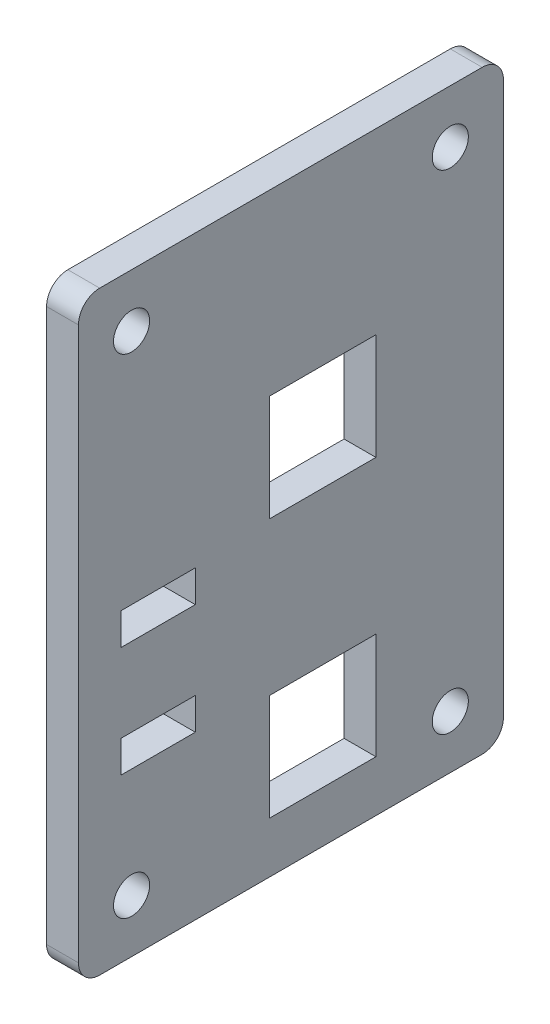
ISO-10303-21;
HEADER;
FILE_DESCRIPTION(('STEP AP214'),'2;1');
FILE_NAME('part.step','',(''),(''),'','','');
FILE_SCHEMA(('AUTOMOTIVE_DESIGN { 1 0 10303 214 1 1 1 1 }'));
ENDSEC;
DATA;
#1=APPLICATION_CONTEXT('core data for automotive mechanical design processes');
#2=APPLICATION_PROTOCOL_DEFINITION('international standard','automotive_design',2000,#1);
#3=PRODUCT_CONTEXT('',#1,'mechanical');
#4=PRODUCT('Part','Part','',(#3));
#5=PRODUCT_RELATED_PRODUCT_CATEGORY('part','',(#4));
#6=PRODUCT_DEFINITION_FORMATION('','',#4);
#7=PRODUCT_DEFINITION_CONTEXT('part definition',#1,'design');
#8=PRODUCT_DEFINITION('design','',#6,#7);
#9=PRODUCT_DEFINITION_SHAPE('','',#8);
#10=(LENGTH_UNIT() NAMED_UNIT(*) SI_UNIT(.MILLI.,.METRE.));
#11=(NAMED_UNIT(*) PLANE_ANGLE_UNIT() SI_UNIT($,.RADIAN.));
#12=(NAMED_UNIT(*) SI_UNIT($,.STERADIAN.) SOLID_ANGLE_UNIT());
#13=UNCERTAINTY_MEASURE_WITH_UNIT(LENGTH_MEASURE(1.E-05),#10,'distance_accuracy_value','');
#14=(GEOMETRIC_REPRESENTATION_CONTEXT(3) GLOBAL_UNCERTAINTY_ASSIGNED_CONTEXT((#13)) GLOBAL_UNIT_ASSIGNED_CONTEXT((#10,
#11,#12)) REPRESENTATION_CONTEXT('',''));
#15=CARTESIAN_POINT('',(0.,0.,0.));
#16=DIRECTION('',(0.,0.,1.));
#17=DIRECTION('',(1.,0.,0.));
#18=AXIS2_PLACEMENT_3D('',#15,#16,#17);
#19=CARTESIAN_POINT('',(-14.9999999999989,231.000000000002,115.));
#20=DIRECTION('',(0.,0.,1.));
#21=DIRECTION('',(0.,-1.,0.));
#22=AXIS2_PLACEMENT_3D('',#19,#20,#21);
#23=PLANE('',#22);
#24=DIRECTION('',(0.,-1.,0.));
#25=VECTOR('',#24,1.);
#26=CARTESIAN_POINT('',(1.11022302462516E-12,231.000000000002,115.));
#27=LINE('',#26,#25);
#28=CARTESIAN_POINT('',(1.11022302462516E-12,221.000000000002,114.999999999999));
#29=VERTEX_POINT('',#28);
#30=CARTESIAN_POINT('',(0.,-38.9999999999998,114.999999999999));
#31=VERTEX_POINT('',#30);
#32=EDGE_CURVE('E402',#29,#31,#27,.T.);
#33=ORIENTED_EDGE('',*,*,#32,.F.);
#34=DIRECTION('',(1.,0.,0.));
#35=VECTOR('',#34,1.);
#36=CARTESIAN_POINT('',(-14.9999999999989,221.000000000002,114.999999999999));
#37=LINE('',#36,#35);
#38=CARTESIAN_POINT('',(-14.9999999999989,221.000000000002,114.999999999999));
#39=VERTEX_POINT('',#38);
#40=EDGE_CURVE('E485',#29,#39,#37,.F.);
#41=ORIENTED_EDGE('',*,*,#40,.T.);
#42=DIRECTION('',(0.,-1.,0.));
#43=VECTOR('',#42,1.);
#44=CARTESIAN_POINT('',(-14.9999999999989,231.000000000002,115.));
#45=LINE('',#44,#43);
#46=CARTESIAN_POINT('',(-15.,-38.9999999999953,114.999999999999));
#47=VERTEX_POINT('',#46);
#48=EDGE_CURVE('E412',#39,#47,#45,.T.);
#49=ORIENTED_EDGE('',*,*,#48,.T.);
#50=DIRECTION('',(1.,0.,0.));
#51=VECTOR('',#50,1.);
#52=CARTESIAN_POINT('',(-15.,-38.9999999999953,114.999999999999));
#53=LINE('',#52,#51);
#54=EDGE_CURVE('E481',#47,#31,#53,.T.);
#55=ORIENTED_EDGE('',*,*,#54,.T.);
#56=EDGE_LOOP('',(#33,#41,#49,#55));
#57=FACE_BOUND('',#56,.T.);
#58=ADVANCED_FACE('F38',(#57),#23,.T.);
#59=CARTESIAN_POINT('',(-14.9999999999989,231.000000000002,115.));
#60=DIRECTION('',(0.,1.,0.));
#61=DIRECTION('',(0.,0.,1.));
#62=AXIS2_PLACEMENT_3D('',#59,#60,#61);
#63=PLANE('',#62);
#64=DIRECTION('',(0.,0.,1.));
#65=VECTOR('',#64,1.);
#66=CARTESIAN_POINT('',(1.11022302462516E-12,231.000000000002,115.));
#67=LINE('',#66,#65);
#68=CARTESIAN_POINT('',(1.11022302462516E-12,231.000000000002,-75.));
#69=VERTEX_POINT('',#68);
#70=CARTESIAN_POINT('',(1.11022302462516E-12,231.000000000002,105.));
#71=VERTEX_POINT('',#70);
#72=EDGE_CURVE('E417',#69,#71,#67,.T.);
#73=ORIENTED_EDGE('',*,*,#72,.F.);
#74=DIRECTION('',(1.,0.,0.));
#75=VECTOR('',#74,1.);
#76=CARTESIAN_POINT('',(-14.9999999999989,231.000000000002,-75.));
#77=LINE('',#76,#75);
#78=CARTESIAN_POINT('',(-14.9999999999989,231.000000000002,-75.));
#79=VERTEX_POINT('',#78);
#80=EDGE_CURVE('E466',#69,#79,#77,.F.);
#81=ORIENTED_EDGE('',*,*,#80,.T.);
#82=DIRECTION('',(0.,0.,1.));
#83=VECTOR('',#82,1.);
#84=CARTESIAN_POINT('',(-14.9999999999989,231.000000000002,115.));
#85=LINE('',#84,#83);
#86=CARTESIAN_POINT('',(-14.9999999999989,231.000000000002,105.));
#87=VERTEX_POINT('',#86);
#88=EDGE_CURVE('E425',#79,#87,#85,.T.);
#89=ORIENTED_EDGE('',*,*,#88,.T.);
#90=DIRECTION('',(1.,0.,0.));
#91=VECTOR('',#90,1.);
#92=CARTESIAN_POINT('',(-14.9999999999989,231.000000000002,105.));
#93=LINE('',#92,#91);
#94=EDGE_CURVE('E462',#87,#71,#93,.T.);
#95=ORIENTED_EDGE('',*,*,#94,.T.);
#96=EDGE_LOOP('',(#73,#81,#89,#95));
#97=FACE_BOUND('',#96,.T.);
#98=ADVANCED_FACE('F518',(#97),#63,.T.);
#99=CARTESIAN_POINT('',(-14.9999999999989,231.,-85.));
#100=DIRECTION('',(0.,0.,-1.));
#101=DIRECTION('',(0.,1.,0.));
#102=AXIS2_PLACEMENT_3D('',#99,#100,#101);
#103=PLANE('',#102);
#104=DIRECTION('',(0.,1.,0.));
#105=VECTOR('',#104,1.);
#106=CARTESIAN_POINT('',(-14.9999999999989,231.,-85.));
#107=LINE('',#106,#105);
#108=CARTESIAN_POINT('',(-15.,-39.0000000000004,-85.0000000000011));
#109=VERTEX_POINT('',#108);
#110=CARTESIAN_POINT('',(-14.9999999999989,221.,-85.0000000000011));
#111=VERTEX_POINT('',#110);
#112=EDGE_CURVE('E421',#109,#111,#107,.T.);
#113=ORIENTED_EDGE('',*,*,#112,.T.);
#114=DIRECTION('',(1.,0.,0.));
#115=VECTOR('',#114,1.);
#116=CARTESIAN_POINT('',(-14.9999999999989,221.,-85.0000000000011));
#117=LINE('',#116,#115);
#118=CARTESIAN_POINT('',(1.11022302462516E-12,221.,-85.0000000000011));
#119=VERTEX_POINT('',#118);
#120=EDGE_CURVE('E446',#111,#119,#117,.T.);
#121=ORIENTED_EDGE('',*,*,#120,.T.);
#122=DIRECTION('',(0.,1.,0.));
#123=VECTOR('',#122,1.);
#124=CARTESIAN_POINT('',(1.11022302462516E-12,231.,-85.));
#125=LINE('',#124,#123);
#126=CARTESIAN_POINT('',(0.,-38.9999999999959,-85.0000000000011));
#127=VERTEX_POINT('',#126);
#128=EDGE_CURVE('E437',#127,#119,#125,.T.);
#129=ORIENTED_EDGE('',*,*,#128,.F.);
#130=DIRECTION('',(1.,0.,0.));
#131=VECTOR('',#130,1.);
#132=CARTESIAN_POINT('',(-15.,-39.0000000000004,-85.0000000000011));
#133=LINE('',#132,#131);
#134=EDGE_CURVE('E429',#127,#109,#133,.F.);
#135=ORIENTED_EDGE('',*,*,#134,.T.);
#136=EDGE_LOOP('',(#113,#121,#129,#135));
#137=FACE_BOUND('',#136,.T.);
#138=ADVANCED_FACE('F525',(#137),#103,.T.);
#139=CARTESIAN_POINT('',(-15.,-48.9999999999953,114.999999999999));
#140=DIRECTION('',(0.,-1.,0.));
#141=DIRECTION('',(0.,0.,-1.));
#142=AXIS2_PLACEMENT_3D('',#139,#140,#141);
#143=PLANE('',#142);
#144=DIRECTION('',(0.,0.,-1.));
#145=VECTOR('',#144,1.);
#146=CARTESIAN_POINT('',(0.,-48.9999999999998,115.));
#147=LINE('',#146,#145);
#148=CARTESIAN_POINT('',(0.,-48.9999999999998,105.));
#149=VERTEX_POINT('',#148);
#150=CARTESIAN_POINT('',(0.,-48.9999999999959,-74.9999999999999));
#151=VERTEX_POINT('',#150);
#152=EDGE_CURVE('E433',#149,#151,#147,.T.);
#153=ORIENTED_EDGE('',*,*,#152,.F.);
#154=DIRECTION('',(1.,0.,0.));
#155=VECTOR('',#154,1.);
#156=CARTESIAN_POINT('',(-15.,-48.9999999999953,104.999999999999));
#157=LINE('',#156,#155);
#158=CARTESIAN_POINT('',(-15.,-48.9999999999953,104.999999999999));
#159=VERTEX_POINT('',#158);
#160=EDGE_CURVE('E11',#149,#159,#157,.F.);
#161=ORIENTED_EDGE('',*,*,#160,.T.);
#162=DIRECTION('',(0.,0.,-1.));
#163=VECTOR('',#162,1.);
#164=CARTESIAN_POINT('',(-15.,-48.9999999999953,114.999999999999));
#165=LINE('',#164,#163);
#166=CARTESIAN_POINT('',(-15.,-49.0000000000004,-75.0000000000011));
#167=VERTEX_POINT('',#166);
#168=EDGE_CURVE('E416',#159,#167,#165,.T.);
#169=ORIENTED_EDGE('',*,*,#168,.T.);
#170=DIRECTION('',(1.,0.,0.));
#171=VECTOR('',#170,1.);
#172=CARTESIAN_POINT('',(-15.,-49.0000000000004,-75.0000000000011));
#173=LINE('',#172,#171);
#174=EDGE_CURVE('E47',#167,#151,#173,.T.);
#175=ORIENTED_EDGE('',*,*,#174,.T.);
#176=EDGE_LOOP('',(#153,#161,#169,#175));
#177=FACE_BOUND('',#176,.T.);
#178=ADVANCED_FACE('F494',(#177),#143,.T.);
#179=CARTESIAN_POINT('',(-15.,-3.88578058618805E-13,0.));
#180=DIRECTION('',(1.,0.,0.));
#181=DIRECTION('',(0.,0.,-1.));
#182=AXIS2_PLACEMENT_3D('',#179,#180,#181);
#183=PLANE('',#182);
#184=DIRECTION('',(0.,0.,1.));
#185=VECTOR('',#184,1.);
#186=CARTESIAN_POINT('',(-14.9999999999999,27.5000000000001,60.));
#187=LINE('',#186,#185);
#188=CARTESIAN_POINT('',(-14.9999999999999,27.5000000000001,60.));
#189=VERTEX_POINT('',#188);
#190=CARTESIAN_POINT('',(-14.9999999999999,27.5000000000003,95.));
#191=VERTEX_POINT('',#190);
#192=EDGE_CURVE('E230',#189,#191,#187,.T.);
#193=ORIENTED_EDGE('',*,*,#192,.F.);
#194=DIRECTION('',(0.,-1.,0.));
#195=VECTOR('',#194,1.);
#196=CARTESIAN_POINT('',(-15.,42.5000000000001,60.));
#197=LINE('',#196,#195);
#198=CARTESIAN_POINT('',(-15.,42.5000000000001,60.));
#199=VERTEX_POINT('',#198);
#200=EDGE_CURVE('E219',#199,#189,#197,.T.);
#201=ORIENTED_EDGE('',*,*,#200,.F.);
#202=DIRECTION('',(0.,0.,-1.));
#203=VECTOR('',#202,1.);
#204=CARTESIAN_POINT('',(-15.,42.5000000000001,60.));
#205=LINE('',#204,#203);
#206=CARTESIAN_POINT('',(-15.,42.5,94.9999999999989));
#207=VERTEX_POINT('',#206);
#208=EDGE_CURVE('E234',#207,#199,#205,.T.);
#209=ORIENTED_EDGE('',*,*,#208,.F.);
#210=DIRECTION('',(0.,1.,0.));
#211=VECTOR('',#210,1.);
#212=CARTESIAN_POINT('',(-15.,42.5,94.9999999999989));
#213=LINE('',#212,#211);
#214=EDGE_CURVE('E54',#191,#207,#213,.T.);
#215=ORIENTED_EDGE('',*,*,#214,.F.);
#216=EDGE_LOOP('',(#193,#201,#209,#215));
#217=FACE_BOUND('',#216,.T.);
#218=DIRECTION('',(0.,1.,0.));
#219=VECTOR('',#218,1.);
#220=CARTESIAN_POINT('',(-14.9999999999918,79.5,95.0000000000001));
#221=LINE('',#220,#219);
#222=CARTESIAN_POINT('',(-14.9999999999918,79.5,95.0000000000001));
#223=VERTEX_POINT('',#222);
#224=CARTESIAN_POINT('',(-15.,94.5000000000001,95.));
#225=VERTEX_POINT('',#224);
#226=EDGE_CURVE('E253',#223,#225,#221,.T.);
#227=ORIENTED_EDGE('',*,*,#226,.F.);
#228=DIRECTION('',(0.,0.,1.));
#229=VECTOR('',#228,1.);
#230=CARTESIAN_POINT('',(-14.9999999999918,79.5,59.9999999999999));
#231=LINE('',#230,#229);
#232=CARTESIAN_POINT('',(-14.9999999999918,79.5,59.9999999999999));
#233=VERTEX_POINT('',#232);
#234=EDGE_CURVE('E257',#233,#223,#231,.T.);
#235=ORIENTED_EDGE('',*,*,#234,.F.);
#236=DIRECTION('',(0.,-1.,0.));
#237=VECTOR('',#236,1.);
#238=CARTESIAN_POINT('',(-14.9999999999918,79.5,59.9999999999999));
#239=LINE('',#238,#237);
#240=CARTESIAN_POINT('',(-14.9999999999992,94.5000000000001,60.));
#241=VERTEX_POINT('',#240);
#242=EDGE_CURVE('E261',#241,#233,#239,.T.);
#243=ORIENTED_EDGE('',*,*,#242,.F.);
#244=DIRECTION('',(0.,0.,-1.));
#245=VECTOR('',#244,1.);
#246=CARTESIAN_POINT('',(-14.9999999999992,94.5000000000001,60.));
#247=LINE('',#246,#245);
#248=EDGE_CURVE('E62',#225,#241,#247,.T.);
#249=ORIENTED_EDGE('',*,*,#248,.F.);
#250=EDGE_LOOP('',(#227,#235,#243,#249));
#251=FACE_BOUND('',#250,.T.);
#252=CARTESIAN_POINT('',(-14.9999999999999,-24.0000000000004,-60.0000000000011));
#253=DIRECTION('',(1.,0.,0.));
#254=DIRECTION('',(0.,0.,-1.));
#255=AXIS2_PLACEMENT_3D('',#252,#253,#254);
#256=CIRCLE('',#255,8.50000000000001);
#257=CARTESIAN_POINT('',(-14.9999999999999,-24.0000000000004,-68.5000000000011));
#258=VERTEX_POINT('',#257);
#259=EDGE_CURVE('E292',#258,#258,#256,.T.);
#260=ORIENTED_EDGE('',*,*,#259,.T.);
#261=EDGE_LOOP('',(#260));
#262=FACE_BOUND('',#261,.T.);
#263=CARTESIAN_POINT('',(-14.9999999999989,206.000000000002,89.9999999999989));
#264=DIRECTION('',(1.,0.,0.));
#265=DIRECTION('',(0.,0.,-1.));
#266=AXIS2_PLACEMENT_3D('',#263,#264,#265);
#267=CIRCLE('',#266,8.50000000000001);
#268=CARTESIAN_POINT('',(-14.9999999999989,206.000000000002,81.4999999999989));
#269=VERTEX_POINT('',#268);
#270=EDGE_CURVE('E301',#269,#269,#267,.T.);
#271=ORIENTED_EDGE('',*,*,#270,.T.);
#272=EDGE_LOOP('',(#271));
#273=FACE_BOUND('',#272,.T.);
#274=CARTESIAN_POINT('',(-14.9999999999999,-23.9999999999959,89.9999999999989));
#275=DIRECTION('',(1.,0.,0.));
#276=DIRECTION('',(0.,0.,-1.));
#277=AXIS2_PLACEMENT_3D('',#274,#275,#276);
#278=CIRCLE('',#277,8.50000000000001);
#279=CARTESIAN_POINT('',(-14.9999999999999,-23.9999999999959,81.4999999999989));
#280=VERTEX_POINT('',#279);
#281=EDGE_CURVE('E309',#280,#280,#278,.T.);
#282=ORIENTED_EDGE('',*,*,#281,.T.);
#283=EDGE_LOOP('',(#282));
#284=FACE_BOUND('',#283,.T.);
#285=CARTESIAN_POINT('',(-14.9999999999981,206.000000000002,-60.));
#286=DIRECTION('',(1.,0.,0.));
#287=DIRECTION('',(0.,0.,-1.));
#288=AXIS2_PLACEMENT_3D('',#285,#286,#287);
#289=CIRCLE('',#288,8.50000000000001);
#290=CARTESIAN_POINT('',(-14.9999999999982,206.000000000002,-68.5));
#291=VERTEX_POINT('',#290);
#292=EDGE_CURVE('E316',#291,#291,#289,.T.);
#293=ORIENTED_EDGE('',*,*,#292,.T.);
#294=EDGE_LOOP('',(#293));
#295=FACE_BOUND('',#294,.T.);
#296=DIRECTION('',(0.,0.,1.));
#297=VECTOR('',#296,1.);
#298=CARTESIAN_POINT('',(-14.9999999999918,25.000000000002,-25.0000000000001));
#299=LINE('',#298,#297);
#300=CARTESIAN_POINT('',(-14.9999999999918,25.000000000002,-25.0000000000001));
#301=VERTEX_POINT('',#300);
#302=CARTESIAN_POINT('',(-14.9999999999918,25.0000000000021,24.9999999999997));
#303=VERTEX_POINT('',#302);
#304=EDGE_CURVE('E337',#301,#303,#299,.T.);
#305=ORIENTED_EDGE('',*,*,#304,.T.);
#306=DIRECTION('',(0.,-1.,0.));
#307=VECTOR('',#306,1.);
#308=CARTESIAN_POINT('',(-14.9999999999999,-24.9999999999982,25.));
#309=LINE('',#308,#307);
#310=CARTESIAN_POINT('',(-14.9999999999999,-24.9999999999982,25.));
#311=VERTEX_POINT('',#310);
#312=EDGE_CURVE('E324',#303,#311,#309,.T.);
#313=ORIENTED_EDGE('',*,*,#312,.T.);
#314=DIRECTION('',(0.,0.,-1.));
#315=VECTOR('',#314,1.);
#316=CARTESIAN_POINT('',(-14.9999999999999,-25.0000000000004,-25.0000000000001));
#317=LINE('',#316,#315);
#318=CARTESIAN_POINT('',(-14.9999999999999,-25.0000000000004,-25.0000000000001));
#319=VERTEX_POINT('',#318);
#320=EDGE_CURVE('E328',#311,#319,#317,.T.);
#321=ORIENTED_EDGE('',*,*,#320,.T.);
#322=DIRECTION('',(0.,1.,0.));
#323=VECTOR('',#322,1.);
#324=CARTESIAN_POINT('',(-14.9999999999999,-25.0000000000004,-25.0000000000001));
#325=LINE('',#324,#323);
#326=EDGE_CURVE('E333',#319,#301,#325,.T.);
#327=ORIENTED_EDGE('',*,*,#326,.T.);
#328=EDGE_LOOP('',(#305,#313,#321,#327));
#329=FACE_BOUND('',#328,.T.);
#330=DIRECTION('',(0.,0.,1.));
#331=VECTOR('',#330,1.);
#332=CARTESIAN_POINT('',(-14.9999999999992,147.,24.9999999999997));
#333=LINE('',#332,#331);
#334=CARTESIAN_POINT('',(-14.9999999999992,147.000000000002,-25.0000000000001));
#335=VERTEX_POINT('',#334);
#336=CARTESIAN_POINT('',(-14.9999999999992,147.,24.9999999999997));
#337=VERTEX_POINT('',#336);
#338=EDGE_CURVE('E381',#335,#337,#333,.T.);
#339=ORIENTED_EDGE('',*,*,#338,.T.);
#340=DIRECTION('',(0.,-1.,0.));
#341=VECTOR('',#340,1.);
#342=CARTESIAN_POINT('',(-14.9999999999992,147.,24.9999999999997));
#343=LINE('',#342,#341);
#344=CARTESIAN_POINT('',(-15.,97.0000000000021,25.));
#345=VERTEX_POINT('',#344);
#346=EDGE_CURVE('E368',#337,#345,#343,.T.);
#347=ORIENTED_EDGE('',*,*,#346,.T.);
#348=DIRECTION('',(0.,0.,-1.));
#349=VECTOR('',#348,1.);
#350=CARTESIAN_POINT('',(-15.,97.0000000000021,25.));
#351=LINE('',#350,#349);
#352=CARTESIAN_POINT('',(-14.9999999999992,97.0000000000021,-25.));
#353=VERTEX_POINT('',#352);
#354=EDGE_CURVE('E372',#345,#353,#351,.T.);
#355=ORIENTED_EDGE('',*,*,#354,.T.);
#356=DIRECTION('',(0.,1.,0.));
#357=VECTOR('',#356,1.);
#358=CARTESIAN_POINT('',(-14.9999999999992,147.000000000002,-25.0000000000001));
#359=LINE('',#358,#357);
#360=EDGE_CURVE('E377',#353,#335,#359,.T.);
#361=ORIENTED_EDGE('',*,*,#360,.T.);
#362=EDGE_LOOP('',(#339,#347,#355,#361));
#363=FACE_BOUND('',#362,.T.);
#364=ORIENTED_EDGE('',*,*,#88,.F.);
#365=CARTESIAN_POINT('',(-14.9999999999989,221.000000000002,-75.0000000000011));
#366=DIRECTION('',(1.,0.,0.));
#367=DIRECTION('',(0.,0.,-1.));
#368=AXIS2_PLACEMENT_3D('',#365,#366,#367);
#369=CIRCLE('',#368,10.);
#370=EDGE_CURVE('E478',#79,#111,#369,.F.);
#371=ORIENTED_EDGE('',*,*,#370,.T.);
#372=ORIENTED_EDGE('',*,*,#112,.F.);
#373=CARTESIAN_POINT('',(-15.,-39.0000000000004,-75.0000000000011));
#374=DIRECTION('',(1.,0.,0.));
#375=DIRECTION('',(0.,0.,-1.));
#376=AXIS2_PLACEMENT_3D('',#373,#374,#375);
#377=CIRCLE('',#376,10.);
#378=EDGE_CURVE('E469',#109,#167,#377,.F.);
#379=ORIENTED_EDGE('',*,*,#378,.T.);
#380=ORIENTED_EDGE('',*,*,#168,.F.);
#381=CARTESIAN_POINT('',(-15.,-38.9999999999953,104.999999999999));
#382=DIRECTION('',(1.,0.,0.));
#383=DIRECTION('',(0.,0.,-1.));
#384=AXIS2_PLACEMENT_3D('',#381,#382,#383);
#385=CIRCLE('',#384,10.);
#386=EDGE_CURVE('E472',#159,#47,#385,.F.);
#387=ORIENTED_EDGE('',*,*,#386,.T.);
#388=ORIENTED_EDGE('',*,*,#48,.F.);
#389=CARTESIAN_POINT('',(-14.9999999999989,221.000000000002,104.999999999999));
#390=DIRECTION('',(1.,0.,0.));
#391=DIRECTION('',(0.,0.,-1.));
#392=AXIS2_PLACEMENT_3D('',#389,#390,#391);
#393=CIRCLE('',#392,10.);
#394=EDGE_CURVE('E475',#39,#87,#393,.F.);
#395=ORIENTED_EDGE('',*,*,#394,.T.);
#396=EDGE_LOOP('',(#364,#371,#372,#379,#380,#387,#388,#395));
#397=FACE_BOUND('',#396,.T.);
#398=ADVANCED_FACE('F512',(#217,#251,#262,#273,#284,#295,#329,#363,#397),#183,.F.);
#399=CARTESIAN_POINT('',(0.,0.,0.));
#400=DIRECTION('',(1.,0.,0.));
#401=DIRECTION('',(0.,0.,-1.));
#402=AXIS2_PLACEMENT_3D('',#399,#400,#401);
#403=PLANE('',#402);
#404=DIRECTION('',(0.,-1.,0.));
#405=VECTOR('',#404,1.);
#406=CARTESIAN_POINT('',(0.,42.5000000000001,60.0000000000001));
#407=LINE('',#406,#405);
#408=CARTESIAN_POINT('',(0.,42.5000000000001,60.0000000000001));
#409=VERTEX_POINT('',#408);
#410=CARTESIAN_POINT('',(0.,27.5000000000001,60.));
#411=VERTEX_POINT('',#410);
#412=EDGE_CURVE('E216',#409,#411,#407,.T.);
#413=ORIENTED_EDGE('',*,*,#412,.T.);
#414=DIRECTION('',(0.,0.,1.));
#415=VECTOR('',#414,1.);
#416=CARTESIAN_POINT('',(0.,27.5000000000001,60.));
#417=LINE('',#416,#415);
#418=CARTESIAN_POINT('',(0.,27.5000000000023,95.));
#419=VERTEX_POINT('',#418);
#420=EDGE_CURVE('E201',#411,#419,#417,.T.);
#421=ORIENTED_EDGE('',*,*,#420,.T.);
#422=DIRECTION('',(0.,1.,0.));
#423=VECTOR('',#422,1.);
#424=CARTESIAN_POINT('',(0.,42.5000000000003,94.9999999999989));
#425=LINE('',#424,#423);
#426=CARTESIAN_POINT('',(0.,42.5000000000003,94.9999999999989));
#427=VERTEX_POINT('',#426);
#428=EDGE_CURVE('E240',#419,#427,#425,.T.);
#429=ORIENTED_EDGE('',*,*,#428,.T.);
#430=DIRECTION('',(0.,0.,-1.));
#431=VECTOR('',#430,1.);
#432=CARTESIAN_POINT('',(0.,42.5000000000001,60.0000000000001));
#433=LINE('',#432,#431);
#434=EDGE_CURVE('E225',#427,#409,#433,.T.);
#435=ORIENTED_EDGE('',*,*,#434,.T.);
#436=EDGE_LOOP('',(#413,#421,#429,#435));
#437=FACE_BOUND('',#436,.T.);
#438=DIRECTION('',(0.,0.,1.));
#439=VECTOR('',#438,1.);
#440=CARTESIAN_POINT('',(8.21565038222616E-12,79.5000000000003,60.));
#441=LINE('',#440,#439);
#442=CARTESIAN_POINT('',(8.21565038222616E-12,79.5000000000003,60.));
#443=VERTEX_POINT('',#442);
#444=CARTESIAN_POINT('',(8.21565038222616E-12,79.5000000000003,95.0000000000001));
#445=VERTEX_POINT('',#444);
#446=EDGE_CURVE('E252',#443,#445,#441,.T.);
#447=ORIENTED_EDGE('',*,*,#446,.T.);
#448=DIRECTION('',(0.,1.,0.));
#449=VECTOR('',#448,1.);
#450=CARTESIAN_POINT('',(8.21565038222616E-12,79.5000000000003,95.0000000000001));
#451=LINE('',#450,#449);
#452=CARTESIAN_POINT('',(7.7715611723761E-13,94.5000000000003,95.));
#453=VERTEX_POINT('',#452);
#454=EDGE_CURVE('E280',#445,#453,#451,.T.);
#455=ORIENTED_EDGE('',*,*,#454,.T.);
#456=DIRECTION('',(0.,0.,-1.));
#457=VECTOR('',#456,1.);
#458=CARTESIAN_POINT('',(7.7715611723761E-13,94.5000000000003,60.0000000000001));
#459=LINE('',#458,#457);
#460=CARTESIAN_POINT('',(7.7715611723761E-13,94.5000000000003,60.0000000000001));
#461=VERTEX_POINT('',#460);
#462=EDGE_CURVE('E275',#453,#461,#459,.T.);
#463=ORIENTED_EDGE('',*,*,#462,.T.);
#464=DIRECTION('',(0.,-1.,0.));
#465=VECTOR('',#464,1.);
#466=CARTESIAN_POINT('',(8.21565038222616E-12,79.5000000000003,60.));
#467=LINE('',#466,#465);
#468=EDGE_CURVE('E269',#461,#443,#467,.T.);
#469=ORIENTED_EDGE('',*,*,#468,.T.);
#470=EDGE_LOOP('',(#447,#455,#463,#469));
#471=FACE_BOUND('',#470,.T.);
#472=CARTESIAN_POINT('',(0.,-24.,-60.0000000000002));
#473=DIRECTION('',(1.,0.,0.));
#474=DIRECTION('',(0.,0.,-1.));
#475=AXIS2_PLACEMENT_3D('',#472,#473,#474);
#476=CIRCLE('',#475,8.50000000000001);
#477=CARTESIAN_POINT('',(0.,-24.,-68.5000000000002));
#478=VERTEX_POINT('',#477);
#479=EDGE_CURVE('E297',#478,#478,#476,.T.);
#480=ORIENTED_EDGE('',*,*,#479,.F.);
#481=EDGE_LOOP('',(#480));
#482=FACE_BOUND('',#481,.T.);
#483=CARTESIAN_POINT('',(1.88737914186277E-12,206.000000000002,89.9999999999989));
#484=DIRECTION('',(1.,0.,0.));
#485=DIRECTION('',(0.,0.,-1.));
#486=AXIS2_PLACEMENT_3D('',#483,#484,#485);
#487=CIRCLE('',#486,8.50000000000001);
#488=CARTESIAN_POINT('',(1.84915971424005E-12,206.000000000002,81.4999999999989));
#489=VERTEX_POINT('',#488);
#490=EDGE_CURVE('E305',#489,#489,#487,.T.);
#491=ORIENTED_EDGE('',*,*,#490,.F.);
#492=EDGE_LOOP('',(#491));
#493=FACE_BOUND('',#492,.T.);
#494=CARTESIAN_POINT('',(0.,-23.9999999999998,89.9999999999989));
#495=DIRECTION('',(1.,0.,0.));
#496=DIRECTION('',(0.,0.,-1.));
#497=AXIS2_PLACEMENT_3D('',#494,#495,#496);
#498=CIRCLE('',#497,8.50000000000001);
#499=CARTESIAN_POINT('',(0.,-23.9999999999998,81.4999999999989));
#500=VERTEX_POINT('',#499);
#501=EDGE_CURVE('E249',#500,#500,#498,.T.);
#502=ORIENTED_EDGE('',*,*,#501,.F.);
#503=EDGE_LOOP('',(#502));
#504=FACE_BOUND('',#503,.T.);
#505=CARTESIAN_POINT('',(1.88737914186277E-12,206.000000000002,-60.));
#506=DIRECTION('',(1.,0.,0.));
#507=DIRECTION('',(0.,0.,-1.));
#508=AXIS2_PLACEMENT_3D('',#505,#506,#507);
#509=CIRCLE('',#508,8.50000000000001);
#510=CARTESIAN_POINT('',(1.84915971424005E-12,206.000000000002,-68.5));
#511=VERTEX_POINT('',#510);
#512=EDGE_CURVE('E296',#511,#511,#509,.T.);
#513=ORIENTED_EDGE('',*,*,#512,.F.);
#514=EDGE_LOOP('',(#513));
#515=FACE_BOUND('',#514,.T.);
#516=DIRECTION('',(0.,-1.,0.));
#517=VECTOR('',#516,1.);
#518=CARTESIAN_POINT('',(0.,-25.,25.));
#519=LINE('',#518,#517);
#520=CARTESIAN_POINT('',(8.21565038222616E-12,25.0000000000001,25.));
#521=VERTEX_POINT('',#520);
#522=CARTESIAN_POINT('',(0.,-25.,25.));
#523=VERTEX_POINT('',#522);
#524=EDGE_CURVE('E320',#521,#523,#519,.T.);
#525=ORIENTED_EDGE('',*,*,#524,.F.);
#526=DIRECTION('',(0.,0.,1.));
#527=VECTOR('',#526,1.);
#528=CARTESIAN_POINT('',(8.21565038222616E-12,25.0000000000023,-24.9999999999999));
#529=LINE('',#528,#527);
#530=CARTESIAN_POINT('',(8.21565038222616E-12,25.0000000000023,-24.9999999999999));
#531=VERTEX_POINT('',#530);
#532=EDGE_CURVE('E329',#531,#521,#529,.T.);
#533=ORIENTED_EDGE('',*,*,#532,.F.);
#534=DIRECTION('',(0.,1.,0.));
#535=VECTOR('',#534,1.);
#536=CARTESIAN_POINT('',(0.,-25.,-24.9999999999999));
#537=LINE('',#536,#535);
#538=CARTESIAN_POINT('',(0.,-25.,-24.9999999999999));
#539=VERTEX_POINT('',#538);
#540=EDGE_CURVE('E348',#539,#531,#537,.T.);
#541=ORIENTED_EDGE('',*,*,#540,.F.);
#542=DIRECTION('',(0.,0.,-1.));
#543=VECTOR('',#542,1.);
#544=CARTESIAN_POINT('',(0.,-25.,-24.9999999999999));
#545=LINE('',#544,#543);
#546=EDGE_CURVE('E344',#523,#539,#545,.T.);
#547=ORIENTED_EDGE('',*,*,#546,.F.);
#548=EDGE_LOOP('',(#525,#533,#541,#547));
#549=FACE_BOUND('',#548,.T.);
#550=DIRECTION('',(0.,-1.,0.));
#551=VECTOR('',#550,1.);
#552=CARTESIAN_POINT('',(7.7715611723761E-13,147.,25.));
#553=LINE('',#552,#551);
#554=CARTESIAN_POINT('',(7.7715611723761E-13,147.,25.));
#555=VERTEX_POINT('',#554);
#556=CARTESIAN_POINT('',(0.,97.0000000000001,25.));
#557=VERTEX_POINT('',#556);
#558=EDGE_CURVE('E358',#555,#557,#553,.T.);
#559=ORIENTED_EDGE('',*,*,#558,.F.);
#560=DIRECTION('',(0.,0.,1.));
#561=VECTOR('',#560,1.);
#562=CARTESIAN_POINT('',(7.7715611723761E-13,147.,25.));
#563=LINE('',#562,#561);
#564=CARTESIAN_POINT('',(7.7715611723761E-13,147.000000000002,-25.));
#565=VERTEX_POINT('',#564);
#566=EDGE_CURVE('E373',#565,#555,#563,.T.);
#567=ORIENTED_EDGE('',*,*,#566,.F.);
#568=DIRECTION('',(0.,1.,0.));
#569=VECTOR('',#568,1.);
#570=CARTESIAN_POINT('',(7.7715611723761E-13,147.000000000002,-25.));
#571=LINE('',#570,#569);
#572=CARTESIAN_POINT('',(7.7715611723761E-13,97.0000000000023,-25.));
#573=VERTEX_POINT('',#572);
#574=EDGE_CURVE('E392',#573,#565,#571,.T.);
#575=ORIENTED_EDGE('',*,*,#574,.F.);
#576=DIRECTION('',(0.,0.,-1.));
#577=VECTOR('',#576,1.);
#578=CARTESIAN_POINT('',(0.,97.0000000000001,25.));
#579=LINE('',#578,#577);
#580=EDGE_CURVE('E388',#557,#573,#579,.T.);
#581=ORIENTED_EDGE('',*,*,#580,.F.);
#582=EDGE_LOOP('',(#559,#567,#575,#581));
#583=FACE_BOUND('',#582,.T.);
#584=ORIENTED_EDGE('',*,*,#128,.T.);
#585=CARTESIAN_POINT('',(1.11022302462516E-12,221.000000000002,-75.0000000000011));
#586=DIRECTION('',(1.,0.,0.));
#587=DIRECTION('',(0.,0.,-1.));
#588=AXIS2_PLACEMENT_3D('',#585,#586,#587);
#589=CIRCLE('',#588,10.);
#590=EDGE_CURVE('E459',#119,#69,#589,.T.);
#591=ORIENTED_EDGE('',*,*,#590,.T.);
#592=ORIENTED_EDGE('',*,*,#72,.T.);
#593=CARTESIAN_POINT('',(1.11022302462516E-12,221.000000000002,104.999999999999));
#594=DIRECTION('',(1.,0.,0.));
#595=DIRECTION('',(0.,0.,-1.));
#596=AXIS2_PLACEMENT_3D('',#593,#594,#595);
#597=CIRCLE('',#596,10.);
#598=EDGE_CURVE('E456',#71,#29,#597,.T.);
#599=ORIENTED_EDGE('',*,*,#598,.T.);
#600=ORIENTED_EDGE('',*,*,#32,.T.);
#601=CARTESIAN_POINT('',(0.,-38.9999999999998,104.999999999999));
#602=DIRECTION('',(1.,0.,0.));
#603=DIRECTION('',(0.,0.,-1.));
#604=AXIS2_PLACEMENT_3D('',#601,#602,#603);
#605=CIRCLE('',#604,10.);
#606=EDGE_CURVE('E453',#31,#149,#605,.T.);
#607=ORIENTED_EDGE('',*,*,#606,.T.);
#608=ORIENTED_EDGE('',*,*,#152,.T.);
#609=CARTESIAN_POINT('',(0.,-38.9999999999959,-75.0000000000011));
#610=DIRECTION('',(1.,0.,0.));
#611=DIRECTION('',(0.,0.,-1.));
#612=AXIS2_PLACEMENT_3D('',#609,#610,#611);
#613=CIRCLE('',#612,10.);
#614=EDGE_CURVE('E450',#151,#127,#613,.T.);
#615=ORIENTED_EDGE('',*,*,#614,.T.);
#616=EDGE_LOOP('',(#584,#591,#592,#599,#600,#607,#608,#615));
#617=FACE_BOUND('',#616,.T.);
#618=ADVANCED_FACE('F223',(#437,#471,#482,#493,#504,#515,#549,#583,#617),#403,.T.);
#619=CARTESIAN_POINT('',(-14.9999999999992,147.,24.9999999999997));
#620=DIRECTION('',(0.,0.,1.));
#621=DIRECTION('',(1.,0.,0.));
#622=AXIS2_PLACEMENT_3D('',#619,#620,#621);
#623=PLANE('',#622);
#624=ORIENTED_EDGE('',*,*,#558,.T.);
#625=DIRECTION('',(1.,0.,0.));
#626=VECTOR('',#625,1.);
#627=CARTESIAN_POINT('',(-15.,97.0000000000021,25.));
#628=LINE('',#627,#626);
#629=EDGE_CURVE('E385',#345,#557,#628,.T.);
#630=ORIENTED_EDGE('',*,*,#629,.F.);
#631=ORIENTED_EDGE('',*,*,#346,.F.);
#632=DIRECTION('',(1.,0.,0.));
#633=VECTOR('',#632,1.);
#634=CARTESIAN_POINT('',(-14.9999999999992,147.,24.9999999999997));
#635=LINE('',#634,#633);
#636=EDGE_CURVE('E399',#337,#555,#635,.T.);
#637=ORIENTED_EDGE('',*,*,#636,.T.);
#638=EDGE_LOOP('',(#624,#630,#631,#637));
#639=FACE_BOUND('',#638,.T.);
#640=ADVANCED_FACE('F740',(#639),#623,.F.);
#641=CARTESIAN_POINT('',(-14.9999999999992,147.,24.9999999999997));
#642=DIRECTION('',(0.,1.,0.));
#643=DIRECTION('',(0.,0.,1.));
#644=AXIS2_PLACEMENT_3D('',#641,#642,#643);
#645=PLANE('',#644);
#646=ORIENTED_EDGE('',*,*,#566,.T.);
#647=ORIENTED_EDGE('',*,*,#636,.F.);
#648=ORIENTED_EDGE('',*,*,#338,.F.);
#649=DIRECTION('',(1.,0.,0.));
#650=VECTOR('',#649,1.);
#651=CARTESIAN_POINT('',(-14.9999999999992,147.000000000002,-25.0000000000001));
#652=LINE('',#651,#650);
#653=EDGE_CURVE('E403',#335,#565,#652,.T.);
#654=ORIENTED_EDGE('',*,*,#653,.T.);
#655=EDGE_LOOP('',(#646,#647,#648,#654));
#656=FACE_BOUND('',#655,.T.);
#657=ADVANCED_FACE('F734',(#656),#645,.F.);
#658=CARTESIAN_POINT('',(-14.9999999999992,147.000000000002,-25.0000000000001));
#659=DIRECTION('',(0.,0.,-1.));
#660=DIRECTION('',(-1.,0.,0.));
#661=AXIS2_PLACEMENT_3D('',#658,#659,#660);
#662=PLANE('',#661);
#663=ORIENTED_EDGE('',*,*,#574,.T.);
#664=ORIENTED_EDGE('',*,*,#653,.F.);
#665=ORIENTED_EDGE('',*,*,#360,.F.);
#666=DIRECTION('',(1.,0.,0.));
#667=VECTOR('',#666,1.);
#668=CARTESIAN_POINT('',(-14.9999999999992,97.0000000000021,-25.));
#669=LINE('',#668,#667);
#670=EDGE_CURVE('E406',#353,#573,#669,.T.);
#671=ORIENTED_EDGE('',*,*,#670,.T.);
#672=EDGE_LOOP('',(#663,#664,#665,#671));
#673=FACE_BOUND('',#672,.T.);
#674=ADVANCED_FACE('F739',(#673),#662,.F.);
#675=CARTESIAN_POINT('',(-15.,97.0000000000021,25.));
#676=DIRECTION('',(0.,-1.,0.));
#677=DIRECTION('',(0.,0.,-1.));
#678=AXIS2_PLACEMENT_3D('',#675,#676,#677);
#679=PLANE('',#678);
#680=ORIENTED_EDGE('',*,*,#580,.T.);
#681=ORIENTED_EDGE('',*,*,#670,.F.);
#682=ORIENTED_EDGE('',*,*,#354,.F.);
#683=ORIENTED_EDGE('',*,*,#629,.T.);
#684=EDGE_LOOP('',(#680,#681,#682,#683));
#685=FACE_BOUND('',#684,.T.);
#686=ADVANCED_FACE('F727',(#685),#679,.F.);
#687=CARTESIAN_POINT('',(-14.9999999999999,-24.9999999999982,25.));
#688=DIRECTION('',(0.,0.,1.));
#689=DIRECTION('',(1.,0.,0.));
#690=AXIS2_PLACEMENT_3D('',#687,#688,#689);
#691=PLANE('',#690);
#692=ORIENTED_EDGE('',*,*,#524,.T.);
#693=DIRECTION('',(1.,0.,0.));
#694=VECTOR('',#693,1.);
#695=CARTESIAN_POINT('',(-14.9999999999999,-24.9999999999982,25.));
#696=LINE('',#695,#694);
#697=EDGE_CURVE('E341',#311,#523,#696,.T.);
#698=ORIENTED_EDGE('',*,*,#697,.F.);
#699=ORIENTED_EDGE('',*,*,#312,.F.);
#700=DIRECTION('',(1.,0.,0.));
#701=VECTOR('',#700,1.);
#702=CARTESIAN_POINT('',(-14.9999999999918,25.0000000000021,24.9999999999997));
#703=LINE('',#702,#701);
#704=EDGE_CURVE('E355',#303,#521,#703,.T.);
#705=ORIENTED_EDGE('',*,*,#704,.T.);
#706=EDGE_LOOP('',(#692,#698,#699,#705));
#707=FACE_BOUND('',#706,.T.);
#708=ADVANCED_FACE('F699',(#707),#691,.F.);
#709=CARTESIAN_POINT('',(-14.9999999999918,25.000000000002,-25.0000000000001));
#710=DIRECTION('',(0.,1.,0.));
#711=DIRECTION('',(0.,0.,1.));
#712=AXIS2_PLACEMENT_3D('',#709,#710,#711);
#713=PLANE('',#712);
#714=ORIENTED_EDGE('',*,*,#532,.T.);
#715=ORIENTED_EDGE('',*,*,#704,.F.);
#716=ORIENTED_EDGE('',*,*,#304,.F.);
#717=DIRECTION('',(1.,0.,0.));
#718=VECTOR('',#717,1.);
#719=CARTESIAN_POINT('',(-14.9999999999918,25.000000000002,-25.0000000000001));
#720=LINE('',#719,#718);
#721=EDGE_CURVE('E359',#301,#531,#720,.T.);
#722=ORIENTED_EDGE('',*,*,#721,.T.);
#723=EDGE_LOOP('',(#714,#715,#716,#722));
#724=FACE_BOUND('',#723,.T.);
#725=ADVANCED_FACE('F693',(#724),#713,.F.);
#726=CARTESIAN_POINT('',(-14.9999999999999,-25.0000000000004,-25.0000000000001));
#727=DIRECTION('',(0.,0.,-1.));
#728=DIRECTION('',(-1.,0.,0.));
#729=AXIS2_PLACEMENT_3D('',#726,#727,#728);
#730=PLANE('',#729);
#731=ORIENTED_EDGE('',*,*,#540,.T.);
#732=ORIENTED_EDGE('',*,*,#721,.F.);
#733=ORIENTED_EDGE('',*,*,#326,.F.);
#734=DIRECTION('',(1.,0.,0.));
#735=VECTOR('',#734,1.);
#736=CARTESIAN_POINT('',(-14.9999999999999,-25.0000000000004,-25.0000000000001));
#737=LINE('',#736,#735);
#738=EDGE_CURVE('E362',#319,#539,#737,.T.);
#739=ORIENTED_EDGE('',*,*,#738,.T.);
#740=EDGE_LOOP('',(#731,#732,#733,#739));
#741=FACE_BOUND('',#740,.T.);
#742=ADVANCED_FACE('F698',(#741),#730,.F.);
#743=CARTESIAN_POINT('',(-14.9999999999999,-25.0000000000004,-25.0000000000001));
#744=DIRECTION('',(0.,-1.,0.));
#745=DIRECTION('',(0.,0.,-1.));
#746=AXIS2_PLACEMENT_3D('',#743,#744,#745);
#747=PLANE('',#746);
#748=ORIENTED_EDGE('',*,*,#546,.T.);
#749=ORIENTED_EDGE('',*,*,#738,.F.);
#750=ORIENTED_EDGE('',*,*,#320,.F.);
#751=ORIENTED_EDGE('',*,*,#697,.T.);
#752=EDGE_LOOP('',(#748,#749,#750,#751));
#753=FACE_BOUND('',#752,.T.);
#754=ADVANCED_FACE('F548',(#753),#747,.F.);
#755=CARTESIAN_POINT('',(-14.9999999999989,221.000000000002,-75.0000000000011));
#756=DIRECTION('',(1.,0.,0.));
#757=DIRECTION('',(0.,0.,-1.));
#758=AXIS2_PLACEMENT_3D('',#755,#756,#757);
#759=CYLINDRICAL_SURFACE('',#758,10.);
#760=ORIENTED_EDGE('',*,*,#370,.F.);
#761=ORIENTED_EDGE('',*,*,#80,.F.);
#762=ORIENTED_EDGE('',*,*,#590,.F.);
#763=ORIENTED_EDGE('',*,*,#120,.F.);
#764=EDGE_LOOP('',(#760,#761,#762,#763));
#765=FACE_BOUND('',#764,.T.);
#766=ADVANCED_FACE('F523',(#765),#759,.T.);
#767=CARTESIAN_POINT('',(-14.9999999999989,221.000000000002,104.999999999999));
#768=DIRECTION('',(1.,0.,0.));
#769=DIRECTION('',(0.,0.,-1.));
#770=AXIS2_PLACEMENT_3D('',#767,#768,#769);
#771=CYLINDRICAL_SURFACE('',#770,10.);
#772=ORIENTED_EDGE('',*,*,#394,.F.);
#773=ORIENTED_EDGE('',*,*,#40,.F.);
#774=ORIENTED_EDGE('',*,*,#598,.F.);
#775=ORIENTED_EDGE('',*,*,#94,.F.);
#776=EDGE_LOOP('',(#772,#773,#774,#775));
#777=FACE_BOUND('',#776,.T.);
#778=ADVANCED_FACE('F515',(#777),#771,.T.);
#779=CARTESIAN_POINT('',(-15.,-38.9999999999953,104.999999999999));
#780=DIRECTION('',(1.,0.,0.));
#781=DIRECTION('',(0.,0.,-1.));
#782=AXIS2_PLACEMENT_3D('',#779,#780,#781);
#783=CYLINDRICAL_SURFACE('',#782,10.);
#784=ORIENTED_EDGE('',*,*,#386,.F.);
#785=ORIENTED_EDGE('',*,*,#160,.F.);
#786=ORIENTED_EDGE('',*,*,#606,.F.);
#787=ORIENTED_EDGE('',*,*,#54,.F.);
#788=EDGE_LOOP('',(#784,#785,#786,#787));
#789=FACE_BOUND('',#788,.T.);
#790=ADVANCED_FACE('F505',(#789),#783,.T.);
#791=CARTESIAN_POINT('',(-15.,-39.0000000000004,-75.0000000000011));
#792=DIRECTION('',(1.,0.,0.));
#793=DIRECTION('',(0.,0.,-1.));
#794=AXIS2_PLACEMENT_3D('',#791,#792,#793);
#795=CYLINDRICAL_SURFACE('',#794,10.);
#796=ORIENTED_EDGE('',*,*,#378,.F.);
#797=ORIENTED_EDGE('',*,*,#134,.F.);
#798=ORIENTED_EDGE('',*,*,#614,.F.);
#799=ORIENTED_EDGE('',*,*,#174,.F.);
#800=EDGE_LOOP('',(#796,#797,#798,#799));
#801=FACE_BOUND('',#800,.T.);
#802=ADVANCED_FACE('F40',(#801),#795,.T.);
#803=CARTESIAN_POINT('',(-14.9999999999981,206.000000000002,-60.));
#804=DIRECTION('',(1.,0.,0.));
#805=DIRECTION('',(0.,0.,-1.));
#806=AXIS2_PLACEMENT_3D('',#803,#804,#805);
#807=CYLINDRICAL_SURFACE('',#806,8.50000000000001);
#808=ORIENTED_EDGE('',*,*,#292,.F.);
#809=EDGE_LOOP('',(#808));
#810=FACE_BOUND('',#809,.T.);
#811=ORIENTED_EDGE('',*,*,#512,.T.);
#812=EDGE_LOOP('',(#811));
#813=FACE_BOUND('',#812,.T.);
#814=ADVANCED_FACE('F529',(#810,#813),#807,.F.);
#815=CARTESIAN_POINT('',(-14.9999999999999,-23.9999999999959,89.9999999999989));
#816=DIRECTION('',(1.,0.,0.));
#817=DIRECTION('',(0.,0.,-1.));
#818=AXIS2_PLACEMENT_3D('',#815,#816,#817);
#819=CYLINDRICAL_SURFACE('',#818,8.50000000000001);
#820=ORIENTED_EDGE('',*,*,#281,.F.);
#821=EDGE_LOOP('',(#820));
#822=FACE_BOUND('',#821,.T.);
#823=ORIENTED_EDGE('',*,*,#501,.T.);
#824=EDGE_LOOP('',(#823));
#825=FACE_BOUND('',#824,.T.);
#826=ADVANCED_FACE('F534',(#822,#825),#819,.F.);
#827=CARTESIAN_POINT('',(-14.9999999999989,206.000000000002,89.9999999999989));
#828=DIRECTION('',(1.,0.,0.));
#829=DIRECTION('',(0.,0.,-1.));
#830=AXIS2_PLACEMENT_3D('',#827,#828,#829);
#831=CYLINDRICAL_SURFACE('',#830,8.50000000000001);
#832=ORIENTED_EDGE('',*,*,#270,.F.);
#833=EDGE_LOOP('',(#832));
#834=FACE_BOUND('',#833,.T.);
#835=ORIENTED_EDGE('',*,*,#490,.T.);
#836=EDGE_LOOP('',(#835));
#837=FACE_BOUND('',#836,.T.);
#838=ADVANCED_FACE('F581',(#834,#837),#831,.F.);
#839=CARTESIAN_POINT('',(-14.9999999999999,-24.0000000000004,-60.0000000000011));
#840=DIRECTION('',(1.,0.,0.));
#841=DIRECTION('',(0.,0.,-1.));
#842=AXIS2_PLACEMENT_3D('',#839,#840,#841);
#843=CYLINDRICAL_SURFACE('',#842,8.50000000000001);
#844=ORIENTED_EDGE('',*,*,#259,.F.);
#845=EDGE_LOOP('',(#844));
#846=FACE_BOUND('',#845,.T.);
#847=ORIENTED_EDGE('',*,*,#479,.T.);
#848=EDGE_LOOP('',(#847));
#849=FACE_BOUND('',#848,.T.);
#850=ADVANCED_FACE('F592',(#846,#849),#843,.F.);
#851=CARTESIAN_POINT('',(38.0788655293277,79.500000000002,60.));
#852=DIRECTION('',(0.,-1.,0.));
#853=DIRECTION('',(0.,0.,-1.));
#854=AXIS2_PLACEMENT_3D('',#851,#852,#853);
#855=PLANE('',#854);
#856=DIRECTION('',(-1.,0.,0.));
#857=VECTOR('',#856,1.);
#858=CARTESIAN_POINT('',(38.0788655293277,79.500000000002,60.));
#859=LINE('',#858,#857);
#860=EDGE_CURVE('E273',#443,#233,#859,.T.);
#861=ORIENTED_EDGE('',*,*,#860,.T.);
#862=ORIENTED_EDGE('',*,*,#234,.T.);
#863=DIRECTION('',(-1.,0.,0.));
#864=VECTOR('',#863,1.);
#865=CARTESIAN_POINT('',(38.0788655293196,79.5000000000002,95.));
#866=LINE('',#865,#864);
#867=EDGE_CURVE('E268',#445,#223,#866,.T.);
#868=ORIENTED_EDGE('',*,*,#867,.F.);
#869=ORIENTED_EDGE('',*,*,#446,.F.);
#870=EDGE_LOOP('',(#861,#862,#868,#869));
#871=FACE_BOUND('',#870,.T.);
#872=ADVANCED_FACE('F603',(#871),#855,.F.);
#873=CARTESIAN_POINT('',(38.0788655293196,79.5000000000002,95.));
#874=DIRECTION('',(0.,0.,1.));
#875=DIRECTION('',(1.,0.,0.));
#876=AXIS2_PLACEMENT_3D('',#873,#874,#875);
#877=PLANE('',#876);
#878=ORIENTED_EDGE('',*,*,#867,.T.);
#879=ORIENTED_EDGE('',*,*,#226,.T.);
#880=DIRECTION('',(-1.,0.,0.));
#881=VECTOR('',#880,1.);
#882=CARTESIAN_POINT('',(38.0788655293196,94.5000000000003,95.));
#883=LINE('',#882,#881);
#884=EDGE_CURVE('E279',#453,#225,#883,.T.);
#885=ORIENTED_EDGE('',*,*,#884,.F.);
#886=ORIENTED_EDGE('',*,*,#454,.F.);
#887=EDGE_LOOP('',(#878,#879,#885,#886));
#888=FACE_BOUND('',#887,.T.);
#889=ADVANCED_FACE('F614',(#888),#877,.F.);
#890=CARTESIAN_POINT('',(38.0788655293204,94.500000000002,60.));
#891=DIRECTION('',(0.,1.,0.));
#892=DIRECTION('',(0.,0.,1.));
#893=AXIS2_PLACEMENT_3D('',#890,#891,#892);
#894=PLANE('',#893);
#895=ORIENTED_EDGE('',*,*,#884,.T.);
#896=ORIENTED_EDGE('',*,*,#248,.T.);
#897=DIRECTION('',(-1.,0.,0.));
#898=VECTOR('',#897,1.);
#899=CARTESIAN_POINT('',(38.0788655293204,94.500000000002,60.));
#900=LINE('',#899,#898);
#901=EDGE_CURVE('E274',#461,#241,#900,.T.);
#902=ORIENTED_EDGE('',*,*,#901,.F.);
#903=ORIENTED_EDGE('',*,*,#462,.F.);
#904=EDGE_LOOP('',(#895,#896,#902,#903));
#905=FACE_BOUND('',#904,.T.);
#906=ADVANCED_FACE('F625',(#905),#894,.F.);
#907=CARTESIAN_POINT('',(38.0788655293277,79.500000000002,60.));
#908=DIRECTION('',(0.,0.,-1.));
#909=DIRECTION('',(-1.,0.,0.));
#910=AXIS2_PLACEMENT_3D('',#907,#908,#909);
#911=PLANE('',#910);
#912=ORIENTED_EDGE('',*,*,#901,.T.);
#913=ORIENTED_EDGE('',*,*,#242,.T.);
#914=ORIENTED_EDGE('',*,*,#860,.F.);
#915=ORIENTED_EDGE('',*,*,#468,.F.);
#916=EDGE_LOOP('',(#912,#913,#914,#915));
#917=FACE_BOUND('',#916,.T.);
#918=ADVANCED_FACE('F636',(#917),#911,.F.);
#919=CARTESIAN_POINT('',(38.0788655293196,42.500000000002,60.0000000000001));
#920=DIRECTION('',(0.,0.,-1.));
#921=DIRECTION('',(-1.,0.,0.));
#922=AXIS2_PLACEMENT_3D('',#919,#920,#921);
#923=PLANE('',#922);
#924=DIRECTION('',(-1.,0.,0.));
#925=VECTOR('',#924,1.);
#926=CARTESIAN_POINT('',(38.0788655293196,42.500000000002,60.0000000000001));
#927=LINE('',#926,#925);
#928=EDGE_CURVE('E238',#409,#199,#927,.T.);
#929=ORIENTED_EDGE('',*,*,#928,.T.);
#930=ORIENTED_EDGE('',*,*,#200,.T.);
#931=DIRECTION('',(-1.,0.,0.));
#932=VECTOR('',#931,1.);
#933=CARTESIAN_POINT('',(38.0788655293197,27.500000000002,60.));
#934=LINE('',#933,#932);
#935=EDGE_CURVE('E205',#411,#189,#934,.T.);
#936=ORIENTED_EDGE('',*,*,#935,.F.);
#937=ORIENTED_EDGE('',*,*,#412,.F.);
#938=EDGE_LOOP('',(#929,#930,#936,#937));
#939=FACE_BOUND('',#938,.T.);
#940=ADVANCED_FACE('F215',(#939),#923,.F.);
#941=CARTESIAN_POINT('',(38.0788655293197,27.500000000002,60.));
#942=DIRECTION('',(0.,-1.,0.));
#943=DIRECTION('',(0.,0.,-1.));
#944=AXIS2_PLACEMENT_3D('',#941,#942,#943);
#945=PLANE('',#944);
#946=ORIENTED_EDGE('',*,*,#935,.T.);
#947=ORIENTED_EDGE('',*,*,#192,.T.);
#948=DIRECTION('',(-1.,0.,0.));
#949=VECTOR('',#948,1.);
#950=CARTESIAN_POINT('',(38.0788655293196,27.5000000000001,95.));
#951=LINE('',#950,#949);
#952=EDGE_CURVE('E207',#419,#191,#951,.T.);
#953=ORIENTED_EDGE('',*,*,#952,.F.);
#954=ORIENTED_EDGE('',*,*,#420,.F.);
#955=EDGE_LOOP('',(#946,#947,#953,#954));
#956=FACE_BOUND('',#955,.T.);
#957=ADVANCED_FACE('F203',(#956),#945,.F.);
#958=CARTESIAN_POINT('',(38.0788655293196,42.5000000000001,95.));
#959=DIRECTION('',(0.,0.,1.));
#960=DIRECTION('',(0.,-1.,0.));
#961=AXIS2_PLACEMENT_3D('',#958,#959,#960);
#962=PLANE('',#961);
#963=ORIENTED_EDGE('',*,*,#952,.T.);
#964=ORIENTED_EDGE('',*,*,#214,.T.);
#965=DIRECTION('',(-1.,0.,0.));
#966=VECTOR('',#965,1.);
#967=CARTESIAN_POINT('',(38.0788655293196,42.5000000000001,95.));
#968=LINE('',#967,#966);
#969=EDGE_CURVE('E239',#427,#207,#968,.T.);
#970=ORIENTED_EDGE('',*,*,#969,.F.);
#971=ORIENTED_EDGE('',*,*,#428,.F.);
#972=EDGE_LOOP('',(#963,#964,#970,#971));
#973=FACE_BOUND('',#972,.T.);
#974=ADVANCED_FACE('F665',(#973),#962,.F.);
#975=CARTESIAN_POINT('',(38.0788655293196,42.500000000002,60.0000000000001));
#976=DIRECTION('',(0.,1.,0.));
#977=DIRECTION('',(0.,0.,1.));
#978=AXIS2_PLACEMENT_3D('',#975,#976,#977);
#979=PLANE('',#978);
#980=ORIENTED_EDGE('',*,*,#969,.T.);
#981=ORIENTED_EDGE('',*,*,#208,.T.);
#982=ORIENTED_EDGE('',*,*,#928,.F.);
#983=ORIENTED_EDGE('',*,*,#434,.F.);
#984=EDGE_LOOP('',(#980,#981,#982,#983));
#985=FACE_BOUND('',#984,.T.);
#986=ADVANCED_FACE('F675',(#985),#979,.F.);
#987=CLOSED_SHELL('',(#58,#98,#138,#178,#398,#618,#640,#657,#674,#686,#708,#725,#742,#754,#766,
#778,#790,#802,#814,#826,#838,#850,#872,#889,#906,#918,#940,#957,#974,#986));
#988=MANIFOLD_SOLID_BREP('B2',#987);
#989=ADVANCED_BREP_SHAPE_REPRESENTATION('',(#18,#988),#14);
#990=SHAPE_DEFINITION_REPRESENTATION(#9,#989);
ENDSEC;
END-ISO-10303-21;
